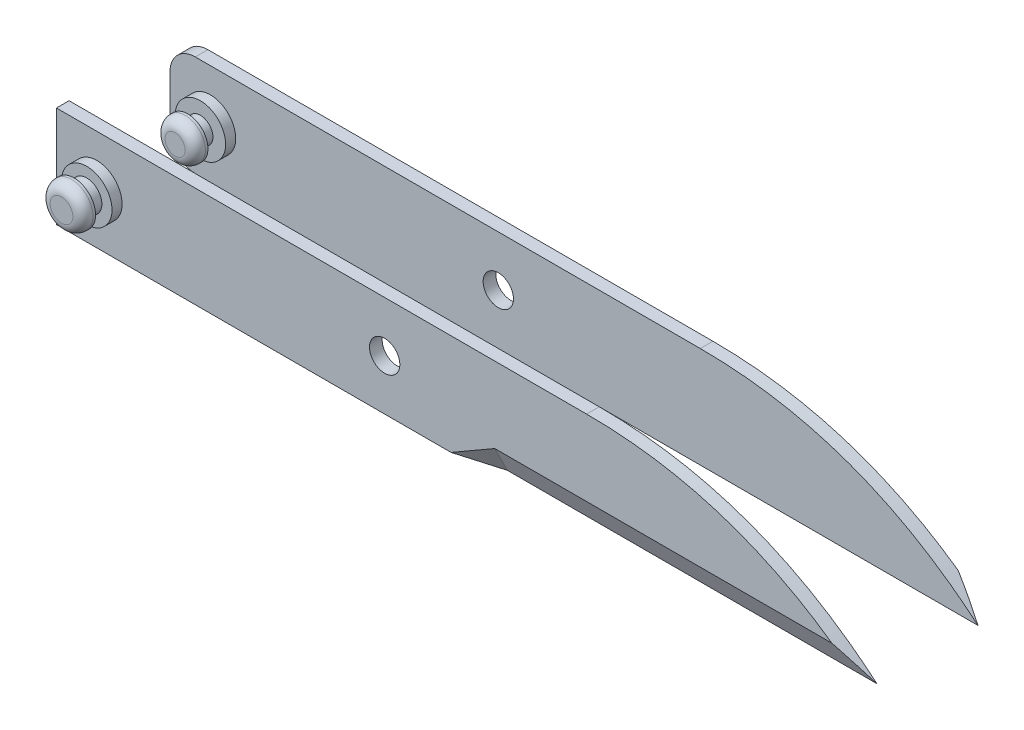
ISO-10303-21;
HEADER;
FILE_DESCRIPTION(('STEP AP214'),'2;1');
FILE_NAME('part.step','',(''),(''),'','','');
FILE_SCHEMA(('AUTOMOTIVE_DESIGN { 1 0 10303 214 1 1 1 1 }'));
ENDSEC;
DATA;
#1=APPLICATION_CONTEXT('core data for automotive mechanical design processes');
#2=APPLICATION_PROTOCOL_DEFINITION('international standard','automotive_design',2000,#1);
#3=PRODUCT_CONTEXT('',#1,'mechanical');
#4=PRODUCT('Part','Part','',(#3));
#5=PRODUCT_RELATED_PRODUCT_CATEGORY('part','',(#4));
#6=PRODUCT_DEFINITION_FORMATION('','',#4);
#7=PRODUCT_DEFINITION_CONTEXT('part definition',#1,'design');
#8=PRODUCT_DEFINITION('design','',#6,#7);
#9=PRODUCT_DEFINITION_SHAPE('','',#8);
#10=(LENGTH_UNIT() NAMED_UNIT(*) SI_UNIT(.MILLI.,.METRE.));
#11=(NAMED_UNIT(*) PLANE_ANGLE_UNIT() SI_UNIT($,.RADIAN.));
#12=(NAMED_UNIT(*) SI_UNIT($,.STERADIAN.) SOLID_ANGLE_UNIT());
#13=UNCERTAINTY_MEASURE_WITH_UNIT(LENGTH_MEASURE(1.E-05),#10,'distance_accuracy_value','');
#14=(GEOMETRIC_REPRESENTATION_CONTEXT(3) GLOBAL_UNCERTAINTY_ASSIGNED_CONTEXT((#13)) GLOBAL_UNIT_ASSIGNED_CONTEXT((#10,
#11,#12)) REPRESENTATION_CONTEXT('',''));
#15=CARTESIAN_POINT('',(0.,0.,0.));
#16=DIRECTION('',(0.,0.,1.));
#17=DIRECTION('',(1.,0.,0.));
#18=AXIS2_PLACEMENT_3D('',#15,#16,#17);
#19=CARTESIAN_POINT('',(0.987611432008317,-1.53296661987941,-19.4548939420733));
#20=DIRECTION('',(0.,0.,-1.));
#21=DIRECTION('',(1.,0.,0.));
#22=AXIS2_PLACEMENT_3D('',#19,#20,#21);
#23=PLANE('',#22);
#24=CARTESIAN_POINT('',(-71.0123885679917,-1.53296661987941,-19.4548939420733));
#25=DIRECTION('',(0.,0.,-1.));
#26=DIRECTION('',(-1.,0.,0.));
#27=AXIS2_PLACEMENT_3D('',#24,#25,#26);
#28=CIRCLE('',#27,5.);
#29=CARTESIAN_POINT('',(-76.0123885679917,-1.53296661987941,-19.4548939420733));
#30=VERTEX_POINT('',#29);
#31=EDGE_CURVE('E124',#30,#30,#28,.F.);
#32=ORIENTED_EDGE('',*,*,#31,.F.);
#33=EDGE_LOOP('',(#32));
#34=FACE_BOUND('',#33,.T.);
#35=CARTESIAN_POINT('',(-14.0123885679917,-1.53296661987941,-19.4548939420733));
#36=DIRECTION('',(0.,0.,1.));
#37=DIRECTION('',(1.,0.,0.));
#38=AXIS2_PLACEMENT_3D('',#35,#36,#37);
#39=CIRCLE('',#38,3.);
#40=CARTESIAN_POINT('',(-11.0123885679917,-1.53296661987941,-19.4548939420733));
#41=VERTEX_POINT('',#40);
#42=EDGE_CURVE('E168',#41,#41,#39,.T.);
#43=ORIENTED_EDGE('',*,*,#42,.F.);
#44=EDGE_LOOP('',(#43));
#45=FACE_BOUND('',#44,.T.);
#46=DIRECTION('',(0.,-1.,0.));
#47=VECTOR('',#46,1.);
#48=CARTESIAN_POINT('',(-79.0123885679917,-11.5329666198794,-19.4548939420733));
#49=LINE('',#48,#47);
#50=CARTESIAN_POINT('',(-79.0123885679917,3.46703338012058,-19.4548939420733));
#51=VERTEX_POINT('',#50);
#52=CARTESIAN_POINT('',(-79.0123885679917,-6.53296661987942,-19.4548939420733));
#53=VERTEX_POINT('',#52);
#54=EDGE_CURVE('E141',#51,#53,#49,.T.);
#55=ORIENTED_EDGE('',*,*,#54,.T.);
#56=CARTESIAN_POINT('',(-74.0123885679917,-6.53296661987942,-19.4548939420733));
#57=DIRECTION('',(0.,0.,-1.));
#58=DIRECTION('',(-1.,0.,0.));
#59=AXIS2_PLACEMENT_3D('',#56,#57,#58);
#60=CIRCLE('',#59,5.);
#61=CARTESIAN_POINT('',(-74.0123885679917,-11.5329666198794,-19.4548939420733));
#62=VERTEX_POINT('',#61);
#63=EDGE_CURVE('E217',#53,#62,#60,.F.);
#64=ORIENTED_EDGE('',*,*,#63,.T.);
#65=DIRECTION('',(1.,0.,0.));
#66=VECTOR('',#65,1.);
#67=CARTESIAN_POINT('',(80.9876114320083,-11.5329666198794,-19.4548939420733));
#68=LINE('',#67,#66);
#69=CARTESIAN_POINT('',(7.79145900930146,-11.5329666198794,-19.4548939420733));
#70=VERTEX_POINT('',#69);
#71=EDGE_CURVE('E138',#62,#70,#68,.T.);
#72=ORIENTED_EDGE('',*,*,#71,.T.);
#73=DIRECTION('',(1.,0.,0.));
#74=VECTOR('',#73,1.);
#75=CARTESIAN_POINT('',(8.93248353530637,-11.5329666198794,-19.4548939420733));
#76=LINE('',#75,#74);
#77=CARTESIAN_POINT('',(80.9876114320083,-11.5329666198794,-19.4548939420733));
#78=VERTEX_POINT('',#77);
#79=EDGE_CURVE('E120',#70,#78,#76,.T.);
#80=ORIENTED_EDGE('',*,*,#79,.T.);
#81=CARTESIAN_POINT('',(25.9876114320083,8.4670333801206,-19.4548939420733));
#82=CARTESIAN_POINT('',(57.4753385252568,8.4670333801206,-19.4548939420733));
#83=CARTESIAN_POINT('',(80.9876114320083,-11.5329666198794,-19.4548939420733));
#84=B_SPLINE_CURVE_WITH_KNOTS('',2,(#81,#82,#83),.UNSPECIFIED.,.F.,.F.,(3,3),(0.,1.),.UNSPECIFIED.);
#85=CARTESIAN_POINT('',(25.9876114320083,8.4670333801206,-19.4548939420733));
#86=VERTEX_POINT('',#85);
#87=EDGE_CURVE('E128',#86,#78,#84,.T.);
#88=ORIENTED_EDGE('',*,*,#87,.F.);
#89=DIRECTION('',(-1.,0.,0.));
#90=VECTOR('',#89,1.);
#91=CARTESIAN_POINT('',(80.9876114320083,8.4670333801206,-19.4548939420733));
#92=LINE('',#91,#90);
#93=CARTESIAN_POINT('',(-74.0123885679917,8.46703338012058,-19.4548939420733));
#94=VERTEX_POINT('',#93);
#95=EDGE_CURVE('E149',#86,#94,#92,.T.);
#96=ORIENTED_EDGE('',*,*,#95,.T.);
#97=CARTESIAN_POINT('',(-74.0123885679917,3.46703338012058,-19.4548939420733));
#98=DIRECTION('',(0.,0.,-1.));
#99=DIRECTION('',(-1.,0.,0.));
#100=AXIS2_PLACEMENT_3D('',#97,#98,#99);
#101=CIRCLE('',#100,5.);
#102=EDGE_CURVE('E219',#94,#51,#101,.F.);
#103=ORIENTED_EDGE('',*,*,#102,.T.);
#104=EDGE_LOOP('',(#55,#64,#72,#80,#88,#96,#103));
#105=FACE_BOUND('',#104,.T.);
#106=ADVANCED_FACE('F49',(#34,#45,#105),#23,.F.);
#107=CARTESIAN_POINT('',(8.93248353530637,-6.5329666198794,-21.9548939420733));
#108=DIRECTION('',(0.,0.447213595499958,0.894427190999916));
#109=DIRECTION('',(0.,0.894427190999916,-0.447213595499958));
#110=AXIS2_PLACEMENT_3D('',#107,#108,#109);
#111=PLANE('',#110);
#112=ORIENTED_EDGE('',*,*,#79,.F.);
#113=DIRECTION('',(0.,-0.894427190999916,0.447213595499958));
#114=VECTOR('',#113,1.);
#115=CARTESIAN_POINT('',(7.79145900930142,-6.53296661987941,-21.9548939420733));
#116=LINE('',#115,#114);
#117=CARTESIAN_POINT('',(7.79145900930141,-6.5329666198794,-21.9548939420733));
#118=VERTEX_POINT('',#117);
#119=EDGE_CURVE('E125',#118,#70,#116,.T.);
#120=ORIENTED_EDGE('',*,*,#119,.F.);
#121=DIRECTION('',(1.,0.,0.));
#122=VECTOR('',#121,1.);
#123=CARTESIAN_POINT('',(8.93248353530637,-6.5329666198794,-21.9548939420733));
#124=LINE('',#123,#122);
#125=CARTESIAN_POINT('',(74.5443639208971,-6.5329666198794,-21.9548939420733));
#126=VERTEX_POINT('',#125);
#127=EDGE_CURVE('E122',#118,#126,#124,.T.);
#128=ORIENTED_EDGE('',*,*,#127,.T.);
#129=CARTESIAN_POINT('',(80.9876114320083,-11.5329666198794,-19.4548939420733));
#130=CARTESIAN_POINT('',(80.7813897416967,-11.3575503557779,-19.5426020741241));
#131=CARTESIAN_POINT('',(80.5743050153145,-11.1829453989438,-19.6299045525411));
#132=CARTESIAN_POINT('',(80.1584762220103,-10.8354496537951,-19.8036524251155));
#133=CARTESIAN_POINT('',(79.9497327375535,-10.6625583078581,-19.890098098084));
#134=CARTESIAN_POINT('',(79.5305682508041,-10.3185074545054,-20.0621235247604));
#135=CARTESIAN_POINT('',(79.3201476947252,-10.1473475122261,-20.1477034959));
#136=CARTESIAN_POINT('',(78.8976107484758,-9.80677754843038,-20.3179884777979));
#137=CARTESIAN_POINT('',(78.6854946631011,-9.63736722441021,-20.4026936398079));
#138=CARTESIAN_POINT('',(78.2595479442781,-9.30031489043603,-20.571219806795));
#139=CARTESIAN_POINT('',(78.045717469118,-9.13267272046505,-20.6550408917805));
#140=CARTESIAN_POINT('',(77.6163188482186,-8.79917227604784,-20.8217911139891));
#141=CARTESIAN_POINT('',(77.4007506762994,-8.63331402856611,-20.90472023773));
#142=CARTESIAN_POINT('',(76.9678622327085,-8.30340450798039,-21.0696749980228));
#143=CARTESIAN_POINT('',(76.7505418190497,-8.1393533839118,-21.1517005600571));
#144=CARTESIAN_POINT('',(76.3141301941639,-7.81307833187551,-21.3148380860753));
#145=CARTESIAN_POINT('',(76.0950386877329,-7.6508547197703,-21.3959498921279));
#146=CARTESIAN_POINT('',(75.6550657792159,-7.32825525813378,-21.5572496229462));
#147=CARTESIAN_POINT('',(75.4341839239434,-7.16787990301323,-21.6374373005064));
#148=CARTESIAN_POINT('',(74.9906111482481,-6.84899789517616,-21.796878304425));
#149=CARTESIAN_POINT('',(74.7679196120928,-6.69049192768178,-21.8761312881722));
#150=CARTESIAN_POINT('',(74.5443639325051,-6.53296661987941,-21.9548939420733));
#151=B_SPLINE_CURVE_WITH_KNOTS('',3,(#129,#130,#131,#132,#133,#134,#135,#136,#137,#138,#139,
#140,#141,#142,#143,#144,#145,#146,#147,#148,#149,#150),.UNSPECIFIED.,.F.,.F.,(4,2,2,2,2,2,2,2,
2,2,4),(0.,0.853765027859149,1.70724245596555,2.56049991677154,3.41360729541232,
4.26663679415937,5.11967916862353,5.97279137549013,6.82604883709006,7.67952948187062,
8.53331381026666),.UNSPECIFIED.);
#152=EDGE_CURVE('E115',#78,#126,#151,.T.);
#153=ORIENTED_EDGE('',*,*,#152,.F.);
#154=EDGE_LOOP('',(#112,#120,#128,#153));
#155=FACE_BOUND('',#154,.T.);
#156=ADVANCED_FACE('F117',(#155),#111,.F.);
#157=CARTESIAN_POINT('',(8.31773845093043,-14.2291190425861,-17.9548939420733));
#158=DIRECTION('',(0.249999999999996,-0.433012701892218,-0.866025403784441));
#159=DIRECTION('',(0.866025403784442,0.499999999999995,0.));
#160=AXIS2_PLACEMENT_3D('',#157,#158,#159);
#161=PLANE('',#160);
#162=ORIENTED_EDGE('',*,*,#119,.T.);
#163=DIRECTION('',(-0.960768922830524,0.,-0.27735009811261));
#164=VECTOR('',#163,1.);
#165=CARTESIAN_POINT('',(8.67695944947487,-11.5329666198794,-19.1992719833225));
#166=LINE('',#165,#164);
#167=CARTESIAN_POINT('',(-0.86879502854309,-11.5329666198794,-21.9548939420733));
#168=VERTEX_POINT('',#167);
#169=EDGE_CURVE('E153',#70,#168,#166,.T.);
#170=ORIENTED_EDGE('',*,*,#169,.T.);
#171=DIRECTION('',(0.866025403784442,0.499999999999995,0.));
#172=VECTOR('',#171,1.);
#173=CARTESIAN_POINT('',(18.1837638547151,-0.532966619879249,-21.9548939420733));
#174=LINE('',#173,#172);
#175=EDGE_CURVE('E159',#168,#118,#174,.T.);
#176=ORIENTED_EDGE('',*,*,#175,.T.);
#177=EDGE_LOOP('',(#162,#170,#176));
#178=FACE_BOUND('',#177,.T.);
#179=ADVANCED_FACE('F175',(#178),#161,.T.);
#180=CARTESIAN_POINT('',(80.9876114320083,-11.5329666198794,-21.9548939420733));
#181=DIRECTION('',(0.,1.,0.));
#182=DIRECTION('',(-1.,0.,0.));
#183=AXIS2_PLACEMENT_3D('',#180,#181,#182);
#184=PLANE('',#183);
#185=ORIENTED_EDGE('',*,*,#71,.F.);
#186=DIRECTION('',(0.,0.,1.));
#187=VECTOR('',#186,1.);
#188=CARTESIAN_POINT('',(-74.0123885679917,-11.5329666198794,-21.9548939420733));
#189=LINE('',#188,#187);
#190=CARTESIAN_POINT('',(-74.0123885679917,-11.5329666198794,-21.9548939420733));
#191=VERTEX_POINT('',#190);
#192=EDGE_CURVE('E72',#62,#191,#189,.F.);
#193=ORIENTED_EDGE('',*,*,#192,.T.);
#194=DIRECTION('',(1.,0.,0.));
#195=VECTOR('',#194,1.);
#196=CARTESIAN_POINT('',(80.9876114320083,-11.5329666198794,-21.9548939420733));
#197=LINE('',#196,#195);
#198=EDGE_CURVE('E148',#191,#168,#197,.T.);
#199=ORIENTED_EDGE('',*,*,#198,.T.);
#200=ORIENTED_EDGE('',*,*,#169,.F.);
#201=EDGE_LOOP('',(#185,#193,#199,#200));
#202=FACE_BOUND('',#201,.T.);
#203=ADVANCED_FACE('F190',(#202),#184,.F.);
#204=CARTESIAN_POINT('',(-79.0123885679917,-11.5329666198794,-21.9548939420733));
#205=DIRECTION('',(1.,0.,0.));
#206=DIRECTION('',(0.,0.,1.));
#207=AXIS2_PLACEMENT_3D('',#204,#205,#206);
#208=PLANE('',#207);
#209=DIRECTION('',(0.,-1.,0.));
#210=VECTOR('',#209,1.);
#211=CARTESIAN_POINT('',(-79.0123885679917,-11.5329666198794,-21.9548939420733));
#212=LINE('',#211,#210);
#213=CARTESIAN_POINT('',(-79.0123885679917,3.46703338012058,-21.9548939420733));
#214=VERTEX_POINT('',#213);
#215=CARTESIAN_POINT('',(-79.0123885679917,-6.53296661987942,-21.9548939420733));
#216=VERTEX_POINT('',#215);
#217=EDGE_CURVE('E145',#214,#216,#212,.T.);
#218=ORIENTED_EDGE('',*,*,#217,.T.);
#219=DIRECTION('',(0.,0.,1.));
#220=VECTOR('',#219,1.);
#221=CARTESIAN_POINT('',(-79.0123885679917,-6.53296661987942,-21.9548939420733));
#222=LINE('',#221,#220);
#223=EDGE_CURVE('E213',#216,#53,#222,.T.);
#224=ORIENTED_EDGE('',*,*,#223,.T.);
#225=ORIENTED_EDGE('',*,*,#54,.F.);
#226=DIRECTION('',(0.,0.,1.));
#227=VECTOR('',#226,1.);
#228=CARTESIAN_POINT('',(-79.0123885679917,3.46703338012058,-21.9548939420733));
#229=LINE('',#228,#227);
#230=EDGE_CURVE('E222',#51,#214,#229,.F.);
#231=ORIENTED_EDGE('',*,*,#230,.T.);
#232=EDGE_LOOP('',(#218,#224,#225,#231));
#233=FACE_BOUND('',#232,.T.);
#234=ADVANCED_FACE('F188',(#233),#208,.F.);
#235=CARTESIAN_POINT('',(80.9876114320083,8.4670333801206,-21.9548939420733));
#236=DIRECTION('',(0.,-1.,0.));
#237=DIRECTION('',(1.,0.,0.));
#238=AXIS2_PLACEMENT_3D('',#235,#236,#237);
#239=PLANE('',#238);
#240=DIRECTION('',(-1.,0.,0.));
#241=VECTOR('',#240,1.);
#242=CARTESIAN_POINT('',(80.9876114320083,8.4670333801206,-21.9548939420733));
#243=LINE('',#242,#241);
#244=CARTESIAN_POINT('',(25.9876114320083,8.4670333801206,-21.9548939420733));
#245=VERTEX_POINT('',#244);
#246=CARTESIAN_POINT('',(-74.0123885679917,8.46703338012058,-21.9548939420733));
#247=VERTEX_POINT('',#246);
#248=EDGE_CURVE('E151',#245,#247,#243,.T.);
#249=ORIENTED_EDGE('',*,*,#248,.T.);
#250=DIRECTION('',(0.,0.,1.));
#251=VECTOR('',#250,1.);
#252=CARTESIAN_POINT('',(-74.0123885679917,8.46703338012058,-21.9548939420733));
#253=LINE('',#252,#251);
#254=EDGE_CURVE('E12',#247,#94,#253,.T.);
#255=ORIENTED_EDGE('',*,*,#254,.T.);
#256=ORIENTED_EDGE('',*,*,#95,.F.);
#257=DIRECTION('',(0.,0.,-1.));
#258=VECTOR('',#257,1.);
#259=CARTESIAN_POINT('',(25.9876114320083,8.4670333801206,-19.4548939420733));
#260=LINE('',#259,#258);
#261=EDGE_CURVE('E131',#86,#245,#260,.T.);
#262=ORIENTED_EDGE('',*,*,#261,.T.);
#263=EDGE_LOOP('',(#249,#255,#256,#262));
#264=FACE_BOUND('',#263,.T.);
#265=ADVANCED_FACE('F185',(#264),#239,.F.);
#266=DIRECTION('',(0.,0.,-1.));
#267=VECTOR('',#266,1.);
#268=SURFACE_OF_LINEAR_EXTRUSION('',#84,#267);
#269=ORIENTED_EDGE('',*,*,#87,.T.);
#270=ORIENTED_EDGE('',*,*,#152,.T.);
#271=CARTESIAN_POINT('',(25.9876114320083,8.4670333801206,-21.9548939420733));
#272=CARTESIAN_POINT('',(57.4753385252568,8.4670333801206,-21.9548939420733));
#273=CARTESIAN_POINT('',(80.9876114320083,-11.5329666198794,-21.9548939420733));
#274=B_SPLINE_CURVE_WITH_KNOTS('',2,(#271,#272,#273),.UNSPECIFIED.,.F.,.F.,(3,3),(0.,1.),.UNSPECIFIED.);
#275=EDGE_CURVE('E135',#245,#126,#274,.T.);
#276=ORIENTED_EDGE('',*,*,#275,.F.);
#277=ORIENTED_EDGE('',*,*,#261,.F.);
#278=EDGE_LOOP('',(#269,#270,#276,#277));
#279=FACE_BOUND('',#278,.T.);
#280=ADVANCED_FACE('F129',(#279),#268,.T.);
#281=CARTESIAN_POINT('',(-14.0123885679917,-1.53296661987941,-17.9548939420733));
#282=DIRECTION('',(0.,0.,-1.));
#283=DIRECTION('',(1.,0.,0.));
#284=AXIS2_PLACEMENT_3D('',#281,#282,#283);
#285=CYLINDRICAL_SURFACE('',#284,3.);
#286=CARTESIAN_POINT('',(-14.0123885679917,-1.53296661987941,-21.9548939420733));
#287=DIRECTION('',(0.,0.,1.));
#288=DIRECTION('',(1.,0.,0.));
#289=AXIS2_PLACEMENT_3D('',#286,#287,#288);
#290=CIRCLE('',#289,3.);
#291=CARTESIAN_POINT('',(-11.0123885679917,-1.53296661987941,-21.9548939420733));
#292=VERTEX_POINT('',#291);
#293=EDGE_CURVE('E236',#292,#292,#290,.T.);
#294=ORIENTED_EDGE('',*,*,#293,.F.);
#295=EDGE_LOOP('',(#294));
#296=FACE_BOUND('',#295,.T.);
#297=ORIENTED_EDGE('',*,*,#42,.T.);
#298=EDGE_LOOP('',(#297));
#299=FACE_BOUND('',#298,.T.);
#300=ADVANCED_FACE('F180',(#296,#299),#285,.F.);
#301=CARTESIAN_POINT('',(0.987611432008317,-1.53296661987941,-21.9548939420733));
#302=DIRECTION('',(0.,0.,-1.));
#303=DIRECTION('',(1.,0.,0.));
#304=AXIS2_PLACEMENT_3D('',#301,#302,#303);
#305=PLANE('',#304);
#306=ORIENTED_EDGE('',*,*,#293,.T.);
#307=EDGE_LOOP('',(#306));
#308=FACE_BOUND('',#307,.T.);
#309=ORIENTED_EDGE('',*,*,#198,.F.);
#310=CARTESIAN_POINT('',(-74.0123885679917,-6.53296661987942,-21.9548939420733));
#311=DIRECTION('',(0.,0.,-1.));
#312=DIRECTION('',(-1.,0.,0.));
#313=AXIS2_PLACEMENT_3D('',#310,#311,#312);
#314=CIRCLE('',#313,5.);
#315=EDGE_CURVE('E57',#191,#216,#314,.T.);
#316=ORIENTED_EDGE('',*,*,#315,.T.);
#317=ORIENTED_EDGE('',*,*,#217,.F.);
#318=CARTESIAN_POINT('',(-74.0123885679917,3.46703338012058,-21.9548939420733));
#319=DIRECTION('',(0.,0.,-1.));
#320=DIRECTION('',(-1.,0.,0.));
#321=AXIS2_PLACEMENT_3D('',#318,#319,#320);
#322=CIRCLE('',#321,5.);
#323=EDGE_CURVE('E64',#214,#247,#322,.T.);
#324=ORIENTED_EDGE('',*,*,#323,.T.);
#325=ORIENTED_EDGE('',*,*,#248,.F.);
#326=ORIENTED_EDGE('',*,*,#275,.T.);
#327=ORIENTED_EDGE('',*,*,#127,.F.);
#328=ORIENTED_EDGE('',*,*,#175,.F.);
#329=EDGE_LOOP('',(#309,#316,#317,#324,#325,#326,#327,#328));
#330=FACE_BOUND('',#329,.T.);
#331=ADVANCED_FACE('F176',(#308,#330),#305,.T.);
#332=CARTESIAN_POINT('',(-71.0123885679917,-1.53296661987941,-17.4548939420733));
#333=DIRECTION('',(0.,0.,-1.));
#334=DIRECTION('',(-1.,0.,0.));
#335=AXIS2_PLACEMENT_3D('',#332,#333,#334);
#336=CYLINDRICAL_SURFACE('',#335,5.);
#337=CARTESIAN_POINT('',(-71.0123885679917,-1.53296661987941,-17.4548939420733));
#338=DIRECTION('',(0.,0.,1.));
#339=DIRECTION('',(1.,0.,0.));
#340=AXIS2_PLACEMENT_3D('',#337,#338,#339);
#341=CIRCLE('',#340,5.);
#342=CARTESIAN_POINT('',(-66.0123885679917,-1.53296661987941,-17.4548939420733));
#343=VERTEX_POINT('',#342);
#344=EDGE_CURVE('E239',#343,#343,#341,.T.);
#345=ORIENTED_EDGE('',*,*,#344,.F.);
#346=EDGE_LOOP('',(#345));
#347=FACE_BOUND('',#346,.T.);
#348=ORIENTED_EDGE('',*,*,#31,.T.);
#349=EDGE_LOOP('',(#348));
#350=FACE_BOUND('',#349,.T.);
#351=ADVANCED_FACE('F179',(#347,#350),#336,.T.);
#352=CARTESIAN_POINT('',(-71.0123885679917,-1.53296661987941,-17.4548939420733));
#353=DIRECTION('',(0.,0.,1.));
#354=DIRECTION('',(1.,0.,0.));
#355=AXIS2_PLACEMENT_3D('',#352,#353,#354);
#356=PLANE('',#355);
#357=CARTESIAN_POINT('',(-71.0123885679917,-1.53296661987941,-17.4548939420733));
#358=DIRECTION('',(0.,0.,1.));
#359=DIRECTION('',(1.,0.,0.));
#360=AXIS2_PLACEMENT_3D('',#357,#358,#359);
#361=CIRCLE('',#360,2.5);
#362=CARTESIAN_POINT('',(-68.5123885679917,-1.53296661987941,-17.4548939420733));
#363=VERTEX_POINT('',#362);
#364=EDGE_CURVE('E257',#363,#363,#361,.T.);
#365=ORIENTED_EDGE('',*,*,#364,.F.);
#366=EDGE_LOOP('',(#365));
#367=FACE_BOUND('',#366,.T.);
#368=ORIENTED_EDGE('',*,*,#344,.T.);
#369=EDGE_LOOP('',(#368));
#370=FACE_BOUND('',#369,.T.);
#371=ADVANCED_FACE('F284',(#367,#370),#356,.T.);
#372=CARTESIAN_POINT('',(-71.0123885679917,-1.53296661987941,-14.9548939420733));
#373=DIRECTION('',(0.,0.,-1.));
#374=DIRECTION('',(-1.,0.,0.));
#375=AXIS2_PLACEMENT_3D('',#372,#373,#374);
#376=CYLINDRICAL_SURFACE('',#375,2.5);
#377=CARTESIAN_POINT('',(-71.0123885679917,-1.53296661987941,-14.9548939420733));
#378=DIRECTION('',(0.,0.,1.));
#379=DIRECTION('',(1.,0.,0.));
#380=AXIS2_PLACEMENT_3D('',#377,#378,#379);
#381=CIRCLE('',#380,2.5);
#382=CARTESIAN_POINT('',(-68.5123885679917,-1.53296661987941,-14.9548939420733));
#383=VERTEX_POINT('',#382);
#384=EDGE_CURVE('E243',#383,#383,#381,.T.);
#385=ORIENTED_EDGE('',*,*,#384,.F.);
#386=EDGE_LOOP('',(#385));
#387=FACE_BOUND('',#386,.T.);
#388=ORIENTED_EDGE('',*,*,#364,.T.);
#389=EDGE_LOOP('',(#388));
#390=FACE_BOUND('',#389,.T.);
#391=ADVANCED_FACE('F280',(#387,#390),#376,.T.);
#392=CARTESIAN_POINT('',(-71.0123885679917,-1.53296661987941,-12.4548939420733));
#393=DIRECTION('',(0.,0.,-1.));
#394=DIRECTION('',(-1.,0.,0.));
#395=AXIS2_PLACEMENT_3D('',#392,#393,#394);
#396=CYLINDRICAL_SURFACE('',#395,4.00000000000001);
#397=CARTESIAN_POINT('',(-71.0123885679917,-1.53296661987941,-14.4548939420733));
#398=DIRECTION('',(0.,0.,1.));
#399=DIRECTION('',(1.,0.,0.));
#400=AXIS2_PLACEMENT_3D('',#397,#398,#399);
#401=CIRCLE('',#400,4.00000000000001);
#402=CARTESIAN_POINT('',(-67.0123885679917,-1.53296661987941,-14.4548939420733));
#403=VERTEX_POINT('',#402);
#404=EDGE_CURVE('E224',#403,#403,#401,.F.);
#405=ORIENTED_EDGE('',*,*,#404,.T.);
#406=EDGE_LOOP('',(#405));
#407=FACE_BOUND('',#406,.T.);
#408=CARTESIAN_POINT('',(-71.0123885679917,-1.53296661987941,-14.9548939420733));
#409=DIRECTION('',(0.,0.,1.));
#410=DIRECTION('',(1.,0.,0.));
#411=AXIS2_PLACEMENT_3D('',#408,#409,#410);
#412=CIRCLE('',#411,4.00000000000001);
#413=CARTESIAN_POINT('',(-67.0123885679917,-1.53296661987941,-14.9548939420733));
#414=VERTEX_POINT('',#413);
#415=EDGE_CURVE('E260',#414,#414,#412,.T.);
#416=ORIENTED_EDGE('',*,*,#415,.T.);
#417=EDGE_LOOP('',(#416));
#418=FACE_BOUND('',#417,.T.);
#419=ADVANCED_FACE('F266',(#407,#418),#396,.T.);
#420=CARTESIAN_POINT('',(-71.0123885679917,-1.53296661987941,-12.4548939420733));
#421=DIRECTION('',(0.,0.,1.));
#422=DIRECTION('',(1.,0.,0.));
#423=AXIS2_PLACEMENT_3D('',#420,#421,#422);
#424=PLANE('',#423);
#425=CARTESIAN_POINT('',(-71.0123885679917,-1.53296661987941,-12.4548939420733));
#426=DIRECTION('',(0.,0.,1.));
#427=DIRECTION('',(1.,0.,0.));
#428=AXIS2_PLACEMENT_3D('',#425,#426,#427);
#429=CIRCLE('',#428,2.00000000000001);
#430=CARTESIAN_POINT('',(-69.0123885679917,-1.53296661987941,-12.4548939420733));
#431=VERTEX_POINT('',#430);
#432=EDGE_CURVE('E227',#431,#431,#429,.T.);
#433=ORIENTED_EDGE('',*,*,#432,.T.);
#434=EDGE_LOOP('',(#433));
#435=FACE_BOUND('',#434,.T.);
#436=ADVANCED_FACE('F269',(#435),#424,.T.);
#437=CARTESIAN_POINT('',(-71.0123885679917,-1.53296661987941,-14.9548939420733));
#438=DIRECTION('',(0.,0.,1.));
#439=DIRECTION('',(1.,0.,0.));
#440=AXIS2_PLACEMENT_3D('',#437,#438,#439);
#441=PLANE('',#440);
#442=ORIENTED_EDGE('',*,*,#384,.T.);
#443=EDGE_LOOP('',(#442));
#444=FACE_BOUND('',#443,.T.);
#445=ORIENTED_EDGE('',*,*,#415,.F.);
#446=EDGE_LOOP('',(#445));
#447=FACE_BOUND('',#446,.T.);
#448=ADVANCED_FACE('F202',(#444,#447),#441,.F.);
#449=CARTESIAN_POINT('',(-71.0123885679917,-1.53296661987941,-14.4548939420733));
#450=DIRECTION('',(0.,0.,1.));
#451=DIRECTION('',(1.,0.,0.));
#452=AXIS2_PLACEMENT_3D('',#449,#450,#451);
#453=TOROIDAL_SURFACE('',#452,2.00000000000001,2.);
#454=ORIENTED_EDGE('',*,*,#404,.F.);
#455=EDGE_LOOP('',(#454));
#456=FACE_BOUND('',#455,.T.);
#457=ORIENTED_EDGE('',*,*,#432,.F.);
#458=EDGE_LOOP('',(#457));
#459=FACE_BOUND('',#458,.T.);
#460=ADVANCED_FACE('F199',(#456,#459),#453,.T.);
#461=CARTESIAN_POINT('',(-74.0123885679917,-6.53296661987942,-21.9548939420733));
#462=DIRECTION('',(0.,0.,1.));
#463=DIRECTION('',(1.,0.,0.));
#464=AXIS2_PLACEMENT_3D('',#461,#462,#463);
#465=CYLINDRICAL_SURFACE('',#464,5.);
#466=ORIENTED_EDGE('',*,*,#315,.F.);
#467=ORIENTED_EDGE('',*,*,#192,.F.);
#468=ORIENTED_EDGE('',*,*,#63,.F.);
#469=ORIENTED_EDGE('',*,*,#223,.F.);
#470=EDGE_LOOP('',(#466,#467,#468,#469));
#471=FACE_BOUND('',#470,.T.);
#472=ADVANCED_FACE('F201',(#471),#465,.T.);
#473=CARTESIAN_POINT('',(-74.0123885679917,3.46703338012058,-21.9548939420733));
#474=DIRECTION('',(0.,0.,1.));
#475=DIRECTION('',(1.,0.,0.));
#476=AXIS2_PLACEMENT_3D('',#473,#474,#475);
#477=CYLINDRICAL_SURFACE('',#476,5.);
#478=ORIENTED_EDGE('',*,*,#323,.F.);
#479=ORIENTED_EDGE('',*,*,#230,.F.);
#480=ORIENTED_EDGE('',*,*,#102,.F.);
#481=ORIENTED_EDGE('',*,*,#254,.F.);
#482=EDGE_LOOP('',(#478,#479,#480,#481));
#483=FACE_BOUND('',#482,.T.);
#484=ADVANCED_FACE('F51',(#483),#477,.T.);
#485=CLOSED_SHELL('',(#106,#156,#179,#203,#234,#265,#280,#300,#331,#351,#371,#391,#419,#436,
#448,#460,#472,#484));
#486=MANIFOLD_SOLID_BREP('B2',#485);
#487=CARTESIAN_POINT('',(-71.0123885679917,-1.53296661987941,7.54510605792665));
#488=DIRECTION('',(0.,0.,-1.));
#489=DIRECTION('',(-1.,0.,0.));
#490=AXIS2_PLACEMENT_3D('',#487,#488,#489);
#491=CYLINDRICAL_SURFACE('',#490,3.00000000000001);
#492=CARTESIAN_POINT('',(-71.0123885679917,-1.53296661987941,5.04510605792665));
#493=DIRECTION('',(0.,0.,1.));
#494=DIRECTION('',(1.,0.,0.));
#495=AXIS2_PLACEMENT_3D('',#492,#493,#494);
#496=CIRCLE('',#495,3.00000000000001);
#497=CARTESIAN_POINT('',(-68.0123885679917,-1.53296661987941,5.04510605792665));
#498=VERTEX_POINT('',#497);
#499=EDGE_CURVE('E420',#498,#498,#496,.T.);
#500=ORIENTED_EDGE('',*,*,#499,.T.);
#501=EDGE_LOOP('',(#500));
#502=FACE_BOUND('',#501,.T.);
#503=CARTESIAN_POINT('',(-71.0123885679917,-1.53296661987941,7.54510605792665));
#504=DIRECTION('',(0.,0.,1.));
#505=DIRECTION('',(1.,0.,0.));
#506=AXIS2_PLACEMENT_3D('',#503,#504,#505);
#507=CIRCLE('',#506,3.00000000000001);
#508=CARTESIAN_POINT('',(-68.0123885679917,-1.53296661987941,7.54510605792665));
#509=VERTEX_POINT('',#508);
#510=EDGE_CURVE('E547',#509,#509,#507,.T.);
#511=ORIENTED_EDGE('',*,*,#510,.F.);
#512=EDGE_LOOP('',(#511));
#513=FACE_BOUND('',#512,.T.);
#514=ADVANCED_FACE('F416',(#502,#513),#491,.T.);
#515=CARTESIAN_POINT('',(-71.0123885679917,-1.53296661987941,10.0451060579267));
#516=DIRECTION('',(0.,0.,-1.));
#517=DIRECTION('',(-1.,0.,0.));
#518=AXIS2_PLACEMENT_3D('',#515,#516,#517);
#519=CYLINDRICAL_SURFACE('',#518,4.25000000000001);
#520=CARTESIAN_POINT('',(-71.0123885679917,-1.53296661987941,8.04510605792665));
#521=DIRECTION('',(0.,0.,1.));
#522=DIRECTION('',(1.,0.,0.));
#523=AXIS2_PLACEMENT_3D('',#520,#521,#522);
#524=CIRCLE('',#523,4.25000000000001);
#525=CARTESIAN_POINT('',(-66.7623885679917,-1.53296661987941,8.04510605792665));
#526=VERTEX_POINT('',#525);
#527=EDGE_CURVE('E47',#526,#526,#524,.F.);
#528=ORIENTED_EDGE('',*,*,#527,.T.);
#529=EDGE_LOOP('',(#528));
#530=FACE_BOUND('',#529,.T.);
#531=CARTESIAN_POINT('',(-71.0123885679917,-1.53296661987941,7.54510605792665));
#532=DIRECTION('',(0.,0.,1.));
#533=DIRECTION('',(1.,0.,0.));
#534=AXIS2_PLACEMENT_3D('',#531,#532,#533);
#535=CIRCLE('',#534,4.25000000000001);
#536=CARTESIAN_POINT('',(-66.7623885679917,-1.53296661987941,7.54510605792665));
#537=VERTEX_POINT('',#536);
#538=EDGE_CURVE('E551',#537,#537,#535,.T.);
#539=ORIENTED_EDGE('',*,*,#538,.T.);
#540=EDGE_LOOP('',(#539));
#541=FACE_BOUND('',#540,.T.);
#542=ADVANCED_FACE('F581',(#530,#541),#519,.T.);
#543=CARTESIAN_POINT('',(-71.0123885679917,-1.53296661987941,10.0451060579267));
#544=DIRECTION('',(0.,0.,1.));
#545=DIRECTION('',(1.,0.,0.));
#546=AXIS2_PLACEMENT_3D('',#543,#544,#545);
#547=PLANE('',#546);
#548=CARTESIAN_POINT('',(-71.0123885679917,-1.53296661987941,10.0451060579267));
#549=DIRECTION('',(0.,0.,1.));
#550=DIRECTION('',(1.,0.,0.));
#551=AXIS2_PLACEMENT_3D('',#548,#549,#550);
#552=CIRCLE('',#551,2.25000000000001);
#553=CARTESIAN_POINT('',(-68.7623885679917,-1.53296661987941,10.0451060579267));
#554=VERTEX_POINT('',#553);
#555=EDGE_CURVE('E425',#554,#554,#552,.T.);
#556=ORIENTED_EDGE('',*,*,#555,.T.);
#557=EDGE_LOOP('',(#556));
#558=FACE_BOUND('',#557,.T.);
#559=ADVANCED_FACE('F585',(#558),#547,.T.);
#560=CARTESIAN_POINT('',(-71.0123885679917,-1.53296661987941,7.54510605792665));
#561=DIRECTION('',(0.,0.,1.));
#562=DIRECTION('',(1.,0.,0.));
#563=AXIS2_PLACEMENT_3D('',#560,#561,#562);
#564=PLANE('',#563);
#565=ORIENTED_EDGE('',*,*,#510,.T.);
#566=EDGE_LOOP('',(#565));
#567=FACE_BOUND('',#566,.T.);
#568=ORIENTED_EDGE('',*,*,#538,.F.);
#569=EDGE_LOOP('',(#568));
#570=FACE_BOUND('',#569,.T.);
#571=ADVANCED_FACE('F589',(#567,#570),#564,.F.);
#572=CARTESIAN_POINT('',(-71.0123885679917,-1.53296661987941,8.04510605792665));
#573=DIRECTION('',(0.,0.,1.));
#574=DIRECTION('',(1.,0.,0.));
#575=AXIS2_PLACEMENT_3D('',#572,#573,#574);
#576=TOROIDAL_SURFACE('',#575,2.25000000000001,2.);
#577=ORIENTED_EDGE('',*,*,#527,.F.);
#578=EDGE_LOOP('',(#577));
#579=FACE_BOUND('',#578,.T.);
#580=ORIENTED_EDGE('',*,*,#555,.F.);
#581=EDGE_LOOP('',(#580));
#582=FACE_BOUND('',#581,.T.);
#583=ADVANCED_FACE('F418',(#579,#582),#576,.T.);
#584=CARTESIAN_POINT('',(-71.0123885679917,-1.53296661987941,5.04510605792665));
#585=DIRECTION('',(0.,0.,-1.));
#586=DIRECTION('',(-1.,0.,0.));
#587=AXIS2_PLACEMENT_3D('',#584,#585,#586);
#588=CYLINDRICAL_SURFACE('',#587,5.);
#589=CARTESIAN_POINT('',(-71.0123885679917,-1.53296661987941,5.04510605792665));
#590=DIRECTION('',(0.,0.,1.));
#591=DIRECTION('',(1.,0.,0.));
#592=AXIS2_PLACEMENT_3D('',#589,#590,#591);
#593=CIRCLE('',#592,5.);
#594=CARTESIAN_POINT('',(-66.0123885679917,-1.53296661987941,5.04510605792665));
#595=VERTEX_POINT('',#594);
#596=EDGE_CURVE('E560',#595,#595,#593,.T.);
#597=ORIENTED_EDGE('',*,*,#596,.F.);
#598=EDGE_LOOP('',(#597));
#599=FACE_BOUND('',#598,.T.);
#600=CARTESIAN_POINT('',(-71.0123885679917,-1.53296661987941,3.04510605792665));
#601=DIRECTION('',(0.,0.,1.));
#602=DIRECTION('',(1.,0.,0.));
#603=AXIS2_PLACEMENT_3D('',#600,#601,#602);
#604=CIRCLE('',#603,5.);
#605=CARTESIAN_POINT('',(-66.0123885679917,-1.53296661987941,3.04510605792665));
#606=VERTEX_POINT('',#605);
#607=EDGE_CURVE('E557',#606,#606,#604,.T.);
#608=ORIENTED_EDGE('',*,*,#607,.T.);
#609=EDGE_LOOP('',(#608));
#610=FACE_BOUND('',#609,.T.);
#611=ADVANCED_FACE('F571',(#599,#610),#588,.T.);
#612=CARTESIAN_POINT('',(-71.0123885679917,-1.53296661987941,5.04510605792665));
#613=DIRECTION('',(0.,0.,1.));
#614=DIRECTION('',(1.,0.,0.));
#615=AXIS2_PLACEMENT_3D('',#612,#613,#614);
#616=PLANE('',#615);
#617=ORIENTED_EDGE('',*,*,#499,.F.);
#618=EDGE_LOOP('',(#617));
#619=FACE_BOUND('',#618,.T.);
#620=ORIENTED_EDGE('',*,*,#596,.T.);
#621=EDGE_LOOP('',(#620));
#622=FACE_BOUND('',#621,.T.);
#623=ADVANCED_FACE('F569',(#619,#622),#616,.T.);
#624=CARTESIAN_POINT('',(0.987611432008317,-1.53296661987941,0.545106057926653));
#625=DIRECTION('',(0.,0.,1.));
#626=DIRECTION('',(1.,0.,0.));
#627=AXIS2_PLACEMENT_3D('',#624,#625,#626);
#628=PLANE('',#627);
#629=CARTESIAN_POINT('',(-14.0123885679917,-1.53296661987941,0.545106057926653));
#630=DIRECTION('',(0.,0.,1.));
#631=DIRECTION('',(1.,0.,0.));
#632=AXIS2_PLACEMENT_3D('',#629,#630,#631);
#633=CIRCLE('',#632,3.);
#634=CARTESIAN_POINT('',(-11.0123885679917,-1.53296661987941,0.545106057926653));
#635=VERTEX_POINT('',#634);
#636=EDGE_CURVE('E518',#635,#635,#633,.T.);
#637=ORIENTED_EDGE('',*,*,#636,.T.);
#638=EDGE_LOOP('',(#637));
#639=FACE_BOUND('',#638,.T.);
#640=DIRECTION('',(-1.,0.,0.));
#641=VECTOR('',#640,1.);
#642=CARTESIAN_POINT('',(80.9876114320083,8.4670333801206,0.545106057926653));
#643=LINE('',#642,#641);
#644=CARTESIAN_POINT('',(25.9876114320083,8.4670333801206,0.545106057926653));
#645=VERTEX_POINT('',#644);
#646=CARTESIAN_POINT('',(-79.0123885679917,8.46703338012058,0.545106057926653));
#647=VERTEX_POINT('',#646);
#648=EDGE_CURVE('E478',#645,#647,#643,.T.);
#649=ORIENTED_EDGE('',*,*,#648,.F.);
#650=CARTESIAN_POINT('',(25.9876114320083,8.4670333801206,0.545106057926653));
#651=CARTESIAN_POINT('',(57.4753385252568,8.4670333801206,0.545106057926653));
#652=CARTESIAN_POINT('',(80.9876114320083,-11.5329666198794,0.545106057926653));
#653=B_SPLINE_CURVE_WITH_KNOTS('',2,(#650,#651,#652),.UNSPECIFIED.,.F.,.F.,(3,3),(0.,1.),.UNSPECIFIED.);
#654=CARTESIAN_POINT('',(80.9876114320083,-11.5329666198794,0.545106057926653));
#655=VERTEX_POINT('',#654);
#656=EDGE_CURVE('E468',#645,#655,#653,.T.);
#657=ORIENTED_EDGE('',*,*,#656,.T.);
#658=DIRECTION('',(1.,0.,0.));
#659=VECTOR('',#658,1.);
#660=CARTESIAN_POINT('',(8.93248353530637,-11.5329666198794,0.545106057926653));
#661=LINE('',#660,#659);
#662=CARTESIAN_POINT('',(7.79145900930146,-11.5329666198794,0.545106057926653));
#663=VERTEX_POINT('',#662);
#664=EDGE_CURVE('E476',#663,#655,#661,.T.);
#665=ORIENTED_EDGE('',*,*,#664,.F.);
#666=DIRECTION('',(1.,0.,0.));
#667=VECTOR('',#666,1.);
#668=CARTESIAN_POINT('',(80.9876114320083,-11.5329666198794,0.545106057926653));
#669=LINE('',#668,#667);
#670=CARTESIAN_POINT('',(-79.0123885679917,-11.5329666198794,0.545106057926653));
#671=VERTEX_POINT('',#670);
#672=EDGE_CURVE('E499',#671,#663,#669,.T.);
#673=ORIENTED_EDGE('',*,*,#672,.F.);
#674=DIRECTION('',(0.,-1.,0.));
#675=VECTOR('',#674,1.);
#676=CARTESIAN_POINT('',(-79.0123885679917,-11.5329666198794,0.545106057926653));
#677=LINE('',#676,#675);
#678=EDGE_CURVE('E484',#647,#671,#677,.T.);
#679=ORIENTED_EDGE('',*,*,#678,.F.);
#680=EDGE_LOOP('',(#649,#657,#665,#673,#679));
#681=FACE_BOUND('',#680,.T.);
#682=ADVANCED_FACE('F475',(#639,#681),#628,.F.);
#683=CARTESIAN_POINT('',(8.93248353530637,-6.5329666198794,3.04510605792665));
#684=DIRECTION('',(0.,0.447213595499958,-0.894427190999916));
#685=DIRECTION('',(0.,0.894427190999916,0.447213595499958));
#686=AXIS2_PLACEMENT_3D('',#683,#684,#685);
#687=PLANE('',#686);
#688=ORIENTED_EDGE('',*,*,#664,.T.);
#689=CARTESIAN_POINT('',(80.9876114320083,-11.5329666198794,0.54510605792665));
#690=CARTESIAN_POINT('',(80.7813897416967,-11.3575503557779,0.632814189977386));
#691=CARTESIAN_POINT('',(80.5743050153145,-11.1829453989438,0.720116668394447));
#692=CARTESIAN_POINT('',(80.1584762220103,-10.8354496537951,0.893864540968798));
#693=CARTESIAN_POINT('',(79.9497327375535,-10.6625583078581,0.98031021393731));
#694=CARTESIAN_POINT('',(79.5305682508041,-10.3185074545054,1.15233564061367));
#695=CARTESIAN_POINT('',(79.3201476947252,-10.1473475122261,1.2379156117533));
#696=CARTESIAN_POINT('',(78.8976107484758,-9.80677754843038,1.40820059365116));
#697=CARTESIAN_POINT('',(78.6854946631011,-9.63736722441021,1.49290575566125));
#698=CARTESIAN_POINT('',(78.2595479442781,-9.30031489043603,1.66143192264834));
#699=CARTESIAN_POINT('',(78.045717469118,-9.13267272046505,1.74525300763383));
#700=CARTESIAN_POINT('',(77.6163188482186,-8.79917227604784,1.91200322984243));
#701=CARTESIAN_POINT('',(77.4007506762994,-8.63331402856611,1.9949323535833));
#702=CARTESIAN_POINT('',(76.9678622327085,-8.30340450798039,2.15988711387616));
#703=CARTESIAN_POINT('',(76.7505418190497,-8.1393533839118,2.24191267591045));
#704=CARTESIAN_POINT('',(76.3141301941639,-7.81307833187551,2.4050502019286));
#705=CARTESIAN_POINT('',(76.0950386877329,-7.65085471977031,2.4861620079812));
#706=CARTESIAN_POINT('',(75.6550657792159,-7.32825525813378,2.64746173879946));
#707=CARTESIAN_POINT('',(75.4341839239434,-7.16787990301323,2.72764941635974));
#708=CARTESIAN_POINT('',(74.9906111482481,-6.84899789517616,2.88709042027827));
#709=CARTESIAN_POINT('',(74.7679196120928,-6.69049192768178,2.96634340402546));
#710=CARTESIAN_POINT('',(74.5443639325051,-6.53296661987941,3.04510605792665));
#711=B_SPLINE_CURVE_WITH_KNOTS('',3,(#689,#690,#691,#692,#693,#694,#695,#696,#697,#698,#699,
#700,#701,#702,#703,#704,#705,#706,#707,#708,#709,#710),.UNSPECIFIED.,.F.,.F.,(4,2,2,2,2,2,2,2,
2,2,4),(0.,0.85376502785915,1.70724245596555,2.56049991677154,3.41360729541232,4.26663679415937,
5.11967916862353,5.97279137549012,6.82604883709006,7.67952948187062,8.53331381026666),.UNSPECIFIED.);
#712=CARTESIAN_POINT('',(74.5443639208971,-6.5329666198794,3.04510605792665));
#713=VERTEX_POINT('',#712);
#714=EDGE_CURVE('E465',#655,#713,#711,.T.);
#715=ORIENTED_EDGE('',*,*,#714,.T.);
#716=DIRECTION('',(1.,0.,0.));
#717=VECTOR('',#716,1.);
#718=CARTESIAN_POINT('',(8.93248353530637,-6.5329666198794,3.04510605792665));
#719=LINE('',#718,#717);
#720=CARTESIAN_POINT('',(7.79145900930141,-6.5329666198794,3.04510605792665));
#721=VERTEX_POINT('',#720);
#722=EDGE_CURVE('E439',#721,#713,#719,.T.);
#723=ORIENTED_EDGE('',*,*,#722,.F.);
#724=DIRECTION('',(0.,-0.894427190999916,-0.447213595499958));
#725=VECTOR('',#724,1.);
#726=CARTESIAN_POINT('',(7.79145900930142,-6.53296661987941,3.04510605792665));
#727=LINE('',#726,#725);
#728=EDGE_CURVE('E471',#721,#663,#727,.T.);
#729=ORIENTED_EDGE('',*,*,#728,.T.);
#730=EDGE_LOOP('',(#688,#715,#723,#729));
#731=FACE_BOUND('',#730,.T.);
#732=ADVANCED_FACE('F481',(#731),#687,.F.);
#733=CARTESIAN_POINT('',(8.31773845093043,-14.2291190425861,-0.954893942073396));
#734=DIRECTION('',(0.249999999999996,-0.433012701892218,0.866025403784441));
#735=DIRECTION('',(0.866025403784442,0.499999999999995,0.));
#736=AXIS2_PLACEMENT_3D('',#733,#734,#735);
#737=PLANE('',#736);
#738=ORIENTED_EDGE('',*,*,#728,.F.);
#739=DIRECTION('',(0.866025403784442,0.499999999999995,0.));
#740=VECTOR('',#739,1.);
#741=CARTESIAN_POINT('',(18.1837638547151,-0.532966619879249,3.04510605792665));
#742=LINE('',#741,#740);
#743=CARTESIAN_POINT('',(-0.86879502854309,-11.5329666198794,3.04510605792665));
#744=VERTEX_POINT('',#743);
#745=EDGE_CURVE('E509',#744,#721,#742,.T.);
#746=ORIENTED_EDGE('',*,*,#745,.F.);
#747=DIRECTION('',(-0.960768922830524,0.,0.27735009811261));
#748=VECTOR('',#747,1.);
#749=CARTESIAN_POINT('',(8.67695944947487,-11.5329666198794,0.289484099175831));
#750=LINE('',#749,#748);
#751=EDGE_CURVE('E507',#663,#744,#750,.T.);
#752=ORIENTED_EDGE('',*,*,#751,.F.);
#753=EDGE_LOOP('',(#738,#746,#752));
#754=FACE_BOUND('',#753,.T.);
#755=ADVANCED_FACE('F632',(#754),#737,.T.);
#756=CARTESIAN_POINT('',(80.9876114320083,-11.5329666198794,3.04510605792665));
#757=DIRECTION('',(0.,1.,0.));
#758=DIRECTION('',(-1.,0.,0.));
#759=AXIS2_PLACEMENT_3D('',#756,#757,#758);
#760=PLANE('',#759);
#761=ORIENTED_EDGE('',*,*,#672,.T.);
#762=ORIENTED_EDGE('',*,*,#751,.T.);
#763=DIRECTION('',(1.,0.,0.));
#764=VECTOR('',#763,1.);
#765=CARTESIAN_POINT('',(80.9876114320083,-11.5329666198794,3.04510605792665));
#766=LINE('',#765,#764);
#767=CARTESIAN_POINT('',(-79.0123885679917,-11.5329666198794,3.04510605792665));
#768=VERTEX_POINT('',#767);
#769=EDGE_CURVE('E491',#768,#744,#766,.T.);
#770=ORIENTED_EDGE('',*,*,#769,.F.);
#771=DIRECTION('',(0.,0.,-1.));
#772=VECTOR('',#771,1.);
#773=CARTESIAN_POINT('',(-79.0123885679917,-11.5329666198794,3.04510605792665));
#774=LINE('',#773,#772);
#775=EDGE_CURVE('E504',#768,#671,#774,.T.);
#776=ORIENTED_EDGE('',*,*,#775,.T.);
#777=EDGE_LOOP('',(#761,#762,#770,#776));
#778=FACE_BOUND('',#777,.T.);
#779=ADVANCED_FACE('F640',(#778),#760,.F.);
#780=CARTESIAN_POINT('',(-79.0123885679917,-11.5329666198794,3.04510605792665));
#781=DIRECTION('',(1.,0.,0.));
#782=DIRECTION('',(0.,0.,-1.));
#783=AXIS2_PLACEMENT_3D('',#780,#781,#782);
#784=PLANE('',#783);
#785=ORIENTED_EDGE('',*,*,#678,.T.);
#786=ORIENTED_EDGE('',*,*,#775,.F.);
#787=DIRECTION('',(0.,-1.,0.));
#788=VECTOR('',#787,1.);
#789=CARTESIAN_POINT('',(-79.0123885679917,-11.5329666198794,3.04510605792665));
#790=LINE('',#789,#788);
#791=CARTESIAN_POINT('',(-79.0123885679917,8.46703338012058,3.04510605792665));
#792=VERTEX_POINT('',#791);
#793=EDGE_CURVE('E488',#792,#768,#790,.T.);
#794=ORIENTED_EDGE('',*,*,#793,.F.);
#795=DIRECTION('',(0.,0.,-1.));
#796=VECTOR('',#795,1.);
#797=CARTESIAN_POINT('',(-79.0123885679917,8.46703338012058,3.04510605792665));
#798=LINE('',#797,#796);
#799=EDGE_CURVE('E496',#792,#647,#798,.T.);
#800=ORIENTED_EDGE('',*,*,#799,.T.);
#801=EDGE_LOOP('',(#785,#786,#794,#800));
#802=FACE_BOUND('',#801,.T.);
#803=ADVANCED_FACE('F649',(#802),#784,.F.);
#804=CARTESIAN_POINT('',(80.9876114320083,8.4670333801206,3.04510605792665));
#805=DIRECTION('',(0.,-1.,0.));
#806=DIRECTION('',(1.,0.,0.));
#807=AXIS2_PLACEMENT_3D('',#804,#805,#806);
#808=PLANE('',#807);
#809=DIRECTION('',(-1.,0.,0.));
#810=VECTOR('',#809,1.);
#811=CARTESIAN_POINT('',(80.9876114320083,8.4670333801206,3.04510605792665));
#812=LINE('',#811,#810);
#813=CARTESIAN_POINT('',(25.9876114320083,8.4670333801206,3.04510605792665));
#814=VERTEX_POINT('',#813);
#815=EDGE_CURVE('E494',#814,#792,#812,.T.);
#816=ORIENTED_EDGE('',*,*,#815,.F.);
#817=DIRECTION('',(0.,0.,1.));
#818=VECTOR('',#817,1.);
#819=CARTESIAN_POINT('',(25.9876114320083,8.4670333801206,0.545106057926653));
#820=LINE('',#819,#818);
#821=EDGE_CURVE('E479',#645,#814,#820,.T.);
#822=ORIENTED_EDGE('',*,*,#821,.F.);
#823=ORIENTED_EDGE('',*,*,#648,.T.);
#824=ORIENTED_EDGE('',*,*,#799,.F.);
#825=EDGE_LOOP('',(#816,#822,#823,#824));
#826=FACE_BOUND('',#825,.T.);
#827=ADVANCED_FACE('F526',(#826),#808,.F.);
#828=DIRECTION('',(0.,0.,1.));
#829=VECTOR('',#828,1.);
#830=SURFACE_OF_LINEAR_EXTRUSION('',#653,#829);
#831=ORIENTED_EDGE('',*,*,#656,.F.);
#832=ORIENTED_EDGE('',*,*,#821,.T.);
#833=CARTESIAN_POINT('',(25.9876114320083,8.4670333801206,3.04510605792665));
#834=CARTESIAN_POINT('',(57.4753385252568,8.4670333801206,3.04510605792665));
#835=CARTESIAN_POINT('',(80.9876114320083,-11.5329666198794,3.04510605792665));
#836=B_SPLINE_CURVE_WITH_KNOTS('',2,(#833,#834,#835),.UNSPECIFIED.,.F.,.F.,(3,3),(0.,1.),.UNSPECIFIED.);
#837=EDGE_CURVE('E432',#814,#713,#836,.T.);
#838=ORIENTED_EDGE('',*,*,#837,.T.);
#839=ORIENTED_EDGE('',*,*,#714,.F.);
#840=EDGE_LOOP('',(#831,#832,#838,#839));
#841=FACE_BOUND('',#840,.T.);
#842=ADVANCED_FACE('F467',(#841),#830,.F.);
#843=CARTESIAN_POINT('',(-14.0123885679917,-1.53296661987941,-0.954893942073347));
#844=DIRECTION('',(0.,0.,1.));
#845=DIRECTION('',(1.,0.,0.));
#846=AXIS2_PLACEMENT_3D('',#843,#844,#845);
#847=CYLINDRICAL_SURFACE('',#846,3.);
#848=CARTESIAN_POINT('',(-14.0123885679917,-1.53296661987941,3.04510605792665));
#849=DIRECTION('',(0.,0.,1.));
#850=DIRECTION('',(1.,0.,0.));
#851=AXIS2_PLACEMENT_3D('',#848,#849,#850);
#852=CIRCLE('',#851,3.);
#853=CARTESIAN_POINT('',(-11.0123885679917,-1.53296661987941,3.04510605792665));
#854=VERTEX_POINT('',#853);
#855=EDGE_CURVE('E533',#854,#854,#852,.T.);
#856=ORIENTED_EDGE('',*,*,#855,.T.);
#857=EDGE_LOOP('',(#856));
#858=FACE_BOUND('',#857,.T.);
#859=ORIENTED_EDGE('',*,*,#636,.F.);
#860=EDGE_LOOP('',(#859));
#861=FACE_BOUND('',#860,.T.);
#862=ADVANCED_FACE('F525',(#858,#861),#847,.F.);
#863=CARTESIAN_POINT('',(0.987611432008317,-1.53296661987941,3.04510605792665));
#864=DIRECTION('',(0.,0.,1.));
#865=DIRECTION('',(1.,0.,0.));
#866=AXIS2_PLACEMENT_3D('',#863,#864,#865);
#867=PLANE('',#866);
#868=ORIENTED_EDGE('',*,*,#607,.F.);
#869=EDGE_LOOP('',(#868));
#870=FACE_BOUND('',#869,.T.);
#871=ORIENTED_EDGE('',*,*,#855,.F.);
#872=EDGE_LOOP('',(#871));
#873=FACE_BOUND('',#872,.T.);
#874=ORIENTED_EDGE('',*,*,#837,.F.);
#875=ORIENTED_EDGE('',*,*,#815,.T.);
#876=ORIENTED_EDGE('',*,*,#793,.T.);
#877=ORIENTED_EDGE('',*,*,#769,.T.);
#878=ORIENTED_EDGE('',*,*,#745,.T.);
#879=ORIENTED_EDGE('',*,*,#722,.T.);
#880=EDGE_LOOP('',(#874,#875,#876,#877,#878,#879));
#881=FACE_BOUND('',#880,.T.);
#882=ADVANCED_FACE('F683',(#870,#873,#881),#867,.T.);
#883=CLOSED_SHELL('',(#514,#542,#559,#571,#583,#611,#623,#682,#732,#755,#779,#803,#827,#842,
#862,#882));
#884=MANIFOLD_SOLID_BREP('B6_NOT_SHOWN',#883);
#885=ADVANCED_BREP_SHAPE_REPRESENTATION('',(#18,#486,#884),#14);
#886=SHAPE_DEFINITION_REPRESENTATION(#9,#885);
ENDSEC;
END-ISO-10303-21;
